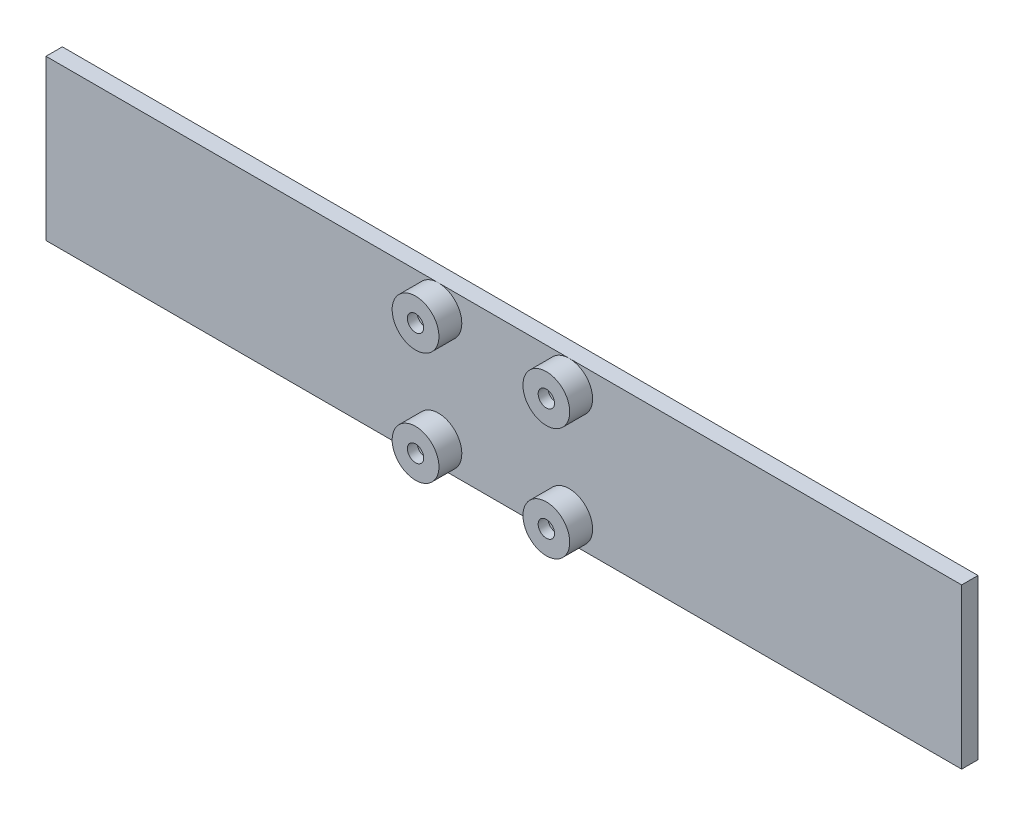
ISO-10303-21;
HEADER;
FILE_DESCRIPTION(('STEP AP214'),'2;1');
FILE_NAME('part.step','',(''),(''),'','','');
FILE_SCHEMA(('AUTOMOTIVE_DESIGN { 1 0 10303 214 1 1 1 1 }'));
ENDSEC;
DATA;
#1=APPLICATION_CONTEXT('core data for automotive mechanical design processes');
#2=APPLICATION_PROTOCOL_DEFINITION('international standard','automotive_design',2000,#1);
#3=PRODUCT_CONTEXT('',#1,'mechanical');
#4=PRODUCT('Part','Part','',(#3));
#5=PRODUCT_RELATED_PRODUCT_CATEGORY('part','',(#4));
#6=PRODUCT_DEFINITION_FORMATION('','',#4);
#7=PRODUCT_DEFINITION_CONTEXT('part definition',#1,'design');
#8=PRODUCT_DEFINITION('design','',#6,#7);
#9=PRODUCT_DEFINITION_SHAPE('','',#8);
#10=(LENGTH_UNIT() NAMED_UNIT(*) SI_UNIT(.MILLI.,.METRE.));
#11=(NAMED_UNIT(*) PLANE_ANGLE_UNIT() SI_UNIT($,.RADIAN.));
#12=(NAMED_UNIT(*) SI_UNIT($,.STERADIAN.) SOLID_ANGLE_UNIT());
#13=UNCERTAINTY_MEASURE_WITH_UNIT(LENGTH_MEASURE(1.E-05),#10,'distance_accuracy_value','');
#14=(GEOMETRIC_REPRESENTATION_CONTEXT(3) GLOBAL_UNCERTAINTY_ASSIGNED_CONTEXT((#13)) GLOBAL_UNIT_ASSIGNED_CONTEXT((#10,
#11,#12)) REPRESENTATION_CONTEXT('',''));
#15=CARTESIAN_POINT('',(0.,0.,0.));
#16=DIRECTION('',(0.,0.,1.));
#17=DIRECTION('',(1.,0.,0.));
#18=AXIS2_PLACEMENT_3D('',#15,#16,#17);
#19=CARTESIAN_POINT('',(-1.58516020236089,28.6172849915683,0.));
#20=DIRECTION('',(0.,0.,1.));
#21=DIRECTION('',(1.,0.,0.));
#22=AXIS2_PLACEMENT_3D('',#19,#20,#21);
#23=CYLINDRICAL_SURFACE('',#22,5.25);
#24=CARTESIAN_POINT('',(-1.58516020236089,28.6172849915683,9.));
#25=DIRECTION('',(0.,0.,1.));
#26=DIRECTION('',(1.,0.,0.));
#27=AXIS2_PLACEMENT_3D('',#24,#25,#26);
#28=CIRCLE('',#27,5.25);
#29=CARTESIAN_POINT('',(3.66483979763911,28.6172849915683,9.));
#30=VERTEX_POINT('',#29);
#31=EDGE_CURVE('E108',#30,#30,#28,.F.);
#32=ORIENTED_EDGE('',*,*,#31,.F.);
#33=EDGE_LOOP('',(#32));
#34=FACE_BOUND('',#33,.T.);
#35=CARTESIAN_POINT('',(-1.58516020236089,28.6172849915683,0.));
#36=DIRECTION('',(0.,0.,1.));
#37=DIRECTION('',(1.,0.,0.));
#38=AXIS2_PLACEMENT_3D('',#35,#36,#37);
#39=CIRCLE('',#38,5.25);
#40=CARTESIAN_POINT('',(3.66483979763911,28.6172849915683,0.));
#41=VERTEX_POINT('',#40);
#42=EDGE_CURVE('E186',#41,#41,#39,.T.);
#43=ORIENTED_EDGE('',*,*,#42,.F.);
#44=EDGE_LOOP('',(#43));
#45=FACE_BOUND('',#44,.T.);
#46=ADVANCED_FACE('F45',(#34,#45),#23,.F.);
#47=CARTESIAN_POINT('',(-1.58516020236089,28.6172849915683,12.));
#48=DIRECTION('',(0.,0.,1.));
#49=DIRECTION('',(1.,0.,0.));
#50=AXIS2_PLACEMENT_3D('',#47,#48,#49);
#51=PLANE('',#50);
#52=CARTESIAN_POINT('',(-1.58516020236089,28.6172849915683,12.));
#53=DIRECTION('',(0.,0.,1.));
#54=DIRECTION('',(1.,0.,0.));
#55=AXIS2_PLACEMENT_3D('',#52,#53,#54);
#56=CIRCLE('',#55,7.14999999999999);
#57=CARTESIAN_POINT('',(5.5648397976391,28.6172849915683,12.));
#58=VERTEX_POINT('',#57);
#59=EDGE_CURVE('E179',#58,#58,#56,.T.);
#60=ORIENTED_EDGE('',*,*,#59,.T.);
#61=EDGE_LOOP('',(#60));
#62=FACE_BOUND('',#61,.T.);
#63=CARTESIAN_POINT('',(-1.58516020236089,28.6172849915683,12.));
#64=DIRECTION('',(0.,0.,1.));
#65=DIRECTION('',(1.,0.,0.));
#66=AXIS2_PLACEMENT_3D('',#63,#64,#65);
#67=CIRCLE('',#66,2.5);
#68=CARTESIAN_POINT('',(0.914839797639113,28.6172849915683,12.));
#69=VERTEX_POINT('',#68);
#70=EDGE_CURVE('E158',#69,#69,#67,.T.);
#71=ORIENTED_EDGE('',*,*,#70,.F.);
#72=EDGE_LOOP('',(#71));
#73=FACE_BOUND('',#72,.T.);
#74=ADVANCED_FACE('F247',(#62,#73),#51,.T.);
#75=CARTESIAN_POINT('',(-1.58516020236089,28.6172849915683,12.));
#76=DIRECTION('',(0.,0.,-1.));
#77=DIRECTION('',(-1.,0.,0.));
#78=AXIS2_PLACEMENT_3D('',#75,#76,#77);
#79=CYLINDRICAL_SURFACE('',#78,7.14999999999999);
#80=CARTESIAN_POINT('',(-1.58516020236089,28.6172849915683,5.));
#81=DIRECTION('',(0.,0.,1.));
#82=DIRECTION('',(1.,0.,0.));
#83=AXIS2_PLACEMENT_3D('',#80,#81,#82);
#84=CIRCLE('',#83,7.14999999999999);
#85=CARTESIAN_POINT('',(-1.58516020236089,35.7672849915683,5.));
#86=VERTEX_POINT('',#85);
#87=EDGE_CURVE('E133',#86,#86,#84,.T.);
#88=ORIENTED_EDGE('',*,*,#87,.T.);
#89=EDGE_LOOP('',(#88));
#90=FACE_BOUND('',#89,.T.);
#91=ORIENTED_EDGE('',*,*,#59,.F.);
#92=EDGE_LOOP('',(#91));
#93=FACE_BOUND('',#92,.T.);
#94=ADVANCED_FACE('F254',(#90,#93),#79,.T.);
#95=CARTESIAN_POINT('',(-1.58516020236089,28.6172849915683,9.));
#96=DIRECTION('',(0.,0.,1.));
#97=DIRECTION('',(1.,0.,0.));
#98=AXIS2_PLACEMENT_3D('',#95,#96,#97);
#99=PLANE('',#98);
#100=CARTESIAN_POINT('',(-1.58516020236089,28.6172849915683,9.));
#101=DIRECTION('',(0.,0.,1.));
#102=DIRECTION('',(1.,0.,0.));
#103=AXIS2_PLACEMENT_3D('',#100,#101,#102);
#104=CIRCLE('',#103,2.5);
#105=CARTESIAN_POINT('',(0.914839797639113,28.6172849915683,9.));
#106=VERTEX_POINT('',#105);
#107=EDGE_CURVE('E163',#106,#106,#104,.T.);
#108=ORIENTED_EDGE('',*,*,#107,.T.);
#109=EDGE_LOOP('',(#108));
#110=FACE_BOUND('',#109,.T.);
#111=ORIENTED_EDGE('',*,*,#31,.T.);
#112=EDGE_LOOP('',(#111));
#113=FACE_BOUND('',#112,.T.);
#114=ADVANCED_FACE('F291',(#110,#113),#99,.F.);
#115=CARTESIAN_POINT('',(-1.58516020236089,28.6172849915683,9.));
#116=DIRECTION('',(0.,0.,1.));
#117=DIRECTION('',(1.,0.,0.));
#118=AXIS2_PLACEMENT_3D('',#115,#116,#117);
#119=CYLINDRICAL_SURFACE('',#118,2.5);
#120=ORIENTED_EDGE('',*,*,#107,.F.);
#121=EDGE_LOOP('',(#120));
#122=FACE_BOUND('',#121,.T.);
#123=ORIENTED_EDGE('',*,*,#70,.T.);
#124=EDGE_LOOP('',(#123));
#125=FACE_BOUND('',#124,.T.);
#126=ADVANCED_FACE('F283',(#122,#125),#119,.F.);
#127=CARTESIAN_POINT('',(0.,0.,5.));
#128=DIRECTION('',(0.,0.,1.));
#129=DIRECTION('',(1.,0.,0.));
#130=AXIS2_PLACEMENT_3D('',#127,#128,#129);
#131=PLANE('',#130);
#132=DIRECTION('',(-1.,0.,0.));
#133=VECTOR('',#132,1.);
#134=CARTESIAN_POINT('',(-121.585160202361,35.7672849915683,5.));
#135=LINE('',#134,#133);
#136=CARTESIAN_POINT('',(38.4148397976391,35.7672849915683,5.));
#137=VERTEX_POINT('',#136);
#138=EDGE_CURVE('E60',#137,#86,#135,.T.);
#139=ORIENTED_EDGE('',*,*,#138,.T.);
#140=ORIENTED_EDGE('',*,*,#87,.F.);
#141=CARTESIAN_POINT('',(-121.585160202361,35.7672849915683,5.));
#142=VERTEX_POINT('',#141);
#143=EDGE_CURVE('E121',#86,#142,#135,.T.);
#144=ORIENTED_EDGE('',*,*,#143,.T.);
#145=DIRECTION('',(0.,-1.,0.));
#146=VECTOR('',#145,1.);
#147=CARTESIAN_POINT('',(-121.585160202361,35.7672849915683,5.));
#148=LINE('',#147,#146);
#149=CARTESIAN_POINT('',(-121.585160202361,-13.0327150084317,5.));
#150=VERTEX_POINT('',#149);
#151=EDGE_CURVE('E104',#142,#150,#148,.T.);
#152=ORIENTED_EDGE('',*,*,#151,.T.);
#153=DIRECTION('',(1.,0.,0.));
#154=VECTOR('',#153,1.);
#155=CARTESIAN_POINT('',(-121.585160202361,-13.0327150084317,5.));
#156=LINE('',#155,#154);
#157=CARTESIAN_POINT('',(-1.58516020236088,-13.0327150084317,5.));
#158=VERTEX_POINT('',#157);
#159=EDGE_CURVE('E111',#150,#158,#156,.T.);
#160=ORIENTED_EDGE('',*,*,#159,.T.);
#161=CARTESIAN_POINT('',(-1.58516020236088,-5.8827150084317,5.));
#162=DIRECTION('',(0.,0.,1.));
#163=DIRECTION('',(1.,0.,0.));
#164=AXIS2_PLACEMENT_3D('',#161,#162,#163);
#165=CIRCLE('',#164,7.15);
#166=EDGE_CURVE('E127',#158,#158,#165,.T.);
#167=ORIENTED_EDGE('',*,*,#166,.F.);
#168=CARTESIAN_POINT('',(38.4148397976391,-13.0327150084317,5.));
#169=VERTEX_POINT('',#168);
#170=EDGE_CURVE('E114',#158,#169,#156,.T.);
#171=ORIENTED_EDGE('',*,*,#170,.T.);
#172=CARTESIAN_POINT('',(38.4148397976391,-5.8827150084317,5.));
#173=DIRECTION('',(0.,0.,1.));
#174=DIRECTION('',(1.,0.,0.));
#175=AXIS2_PLACEMENT_3D('',#172,#173,#174);
#176=CIRCLE('',#175,7.15);
#177=EDGE_CURVE('E11',#169,#169,#176,.T.);
#178=ORIENTED_EDGE('',*,*,#177,.F.);
#179=CARTESIAN_POINT('',(158.414839797639,-13.0327150084317,5.));
#180=VERTEX_POINT('',#179);
#181=EDGE_CURVE('E118',#169,#180,#156,.T.);
#182=ORIENTED_EDGE('',*,*,#181,.T.);
#183=DIRECTION('',(0.,1.,0.));
#184=VECTOR('',#183,1.);
#185=CARTESIAN_POINT('',(158.414839797639,35.7672849915683,5.));
#186=LINE('',#185,#184);
#187=CARTESIAN_POINT('',(158.414839797639,35.7672849915683,5.));
#188=VERTEX_POINT('',#187);
#189=EDGE_CURVE('E116',#180,#188,#186,.T.);
#190=ORIENTED_EDGE('',*,*,#189,.T.);
#191=EDGE_CURVE('E66',#188,#137,#135,.T.);
#192=ORIENTED_EDGE('',*,*,#191,.T.);
#193=CARTESIAN_POINT('',(38.4148397976391,28.6172849915683,5.));
#194=DIRECTION('',(0.,0.,1.));
#195=DIRECTION('',(1.,0.,0.));
#196=AXIS2_PLACEMENT_3D('',#193,#194,#195);
#197=CIRCLE('',#196,7.14999999999998);
#198=EDGE_CURVE('E130',#137,#137,#197,.T.);
#199=ORIENTED_EDGE('',*,*,#198,.F.);
#200=EDGE_LOOP('',(#139,#140,#144,#152,#160,#167,#171,#178,#182,#190,#192,#199));
#201=FACE_BOUND('',#200,.T.);
#202=ADVANCED_FACE('F120',(#201),#131,.T.);
#203=CARTESIAN_POINT('',(-1.58516020236088,-5.8827150084317,9.));
#204=DIRECTION('',(0.,0.,1.));
#205=DIRECTION('',(1.,0.,0.));
#206=AXIS2_PLACEMENT_3D('',#203,#204,#205);
#207=PLANE('',#206);
#208=CARTESIAN_POINT('',(-1.58516020236088,-5.8827150084317,9.));
#209=DIRECTION('',(0.,0.,1.));
#210=DIRECTION('',(1.,0.,0.));
#211=AXIS2_PLACEMENT_3D('',#208,#209,#210);
#212=CIRCLE('',#211,2.5);
#213=CARTESIAN_POINT('',(0.914839797639124,-5.8827150084317,9.));
#214=VERTEX_POINT('',#213);
#215=EDGE_CURVE('E140',#214,#214,#212,.T.);
#216=ORIENTED_EDGE('',*,*,#215,.T.);
#217=EDGE_LOOP('',(#216));
#218=FACE_BOUND('',#217,.T.);
#219=CARTESIAN_POINT('',(-1.58516020236088,-5.8827150084317,9.));
#220=DIRECTION('',(0.,0.,1.));
#221=DIRECTION('',(1.,0.,0.));
#222=AXIS2_PLACEMENT_3D('',#219,#220,#221);
#223=CIRCLE('',#222,5.25);
#224=CARTESIAN_POINT('',(3.66483979763912,-5.8827150084317,9.));
#225=VERTEX_POINT('',#224);
#226=EDGE_CURVE('E145',#225,#225,#223,.F.);
#227=ORIENTED_EDGE('',*,*,#226,.T.);
#228=EDGE_LOOP('',(#227));
#229=FACE_BOUND('',#228,.T.);
#230=ADVANCED_FACE('F282',(#218,#229),#207,.F.);
#231=CARTESIAN_POINT('',(-1.58516020236088,-5.8827150084317,0.));
#232=DIRECTION('',(0.,0.,1.));
#233=DIRECTION('',(1.,0.,0.));
#234=AXIS2_PLACEMENT_3D('',#231,#232,#233);
#235=CYLINDRICAL_SURFACE('',#234,5.25);
#236=ORIENTED_EDGE('',*,*,#226,.F.);
#237=EDGE_LOOP('',(#236));
#238=FACE_BOUND('',#237,.T.);
#239=CARTESIAN_POINT('',(-1.58516020236088,-5.8827150084317,0.));
#240=DIRECTION('',(0.,0.,1.));
#241=DIRECTION('',(1.,0.,0.));
#242=AXIS2_PLACEMENT_3D('',#239,#240,#241);
#243=CIRCLE('',#242,5.25);
#244=CARTESIAN_POINT('',(3.66483979763912,-5.8827150084317,0.));
#245=VERTEX_POINT('',#244);
#246=EDGE_CURVE('E183',#245,#245,#243,.T.);
#247=ORIENTED_EDGE('',*,*,#246,.F.);
#248=EDGE_LOOP('',(#247));
#249=FACE_BOUND('',#248,.T.);
#250=ADVANCED_FACE('F288',(#238,#249),#235,.F.);
#251=CARTESIAN_POINT('',(-1.58516020236088,-5.8827150084317,9.));
#252=DIRECTION('',(0.,0.,1.));
#253=DIRECTION('',(1.,0.,0.));
#254=AXIS2_PLACEMENT_3D('',#251,#252,#253);
#255=CYLINDRICAL_SURFACE('',#254,2.5);
#256=ORIENTED_EDGE('',*,*,#215,.F.);
#257=EDGE_LOOP('',(#256));
#258=FACE_BOUND('',#257,.T.);
#259=CARTESIAN_POINT('',(-1.58516020236088,-5.8827150084317,12.));
#260=DIRECTION('',(0.,0.,1.));
#261=DIRECTION('',(1.,0.,0.));
#262=AXIS2_PLACEMENT_3D('',#259,#260,#261);
#263=CIRCLE('',#262,2.5);
#264=CARTESIAN_POINT('',(0.914839797639124,-5.8827150084317,12.));
#265=VERTEX_POINT('',#264);
#266=EDGE_CURVE('E146',#265,#265,#263,.T.);
#267=ORIENTED_EDGE('',*,*,#266,.T.);
#268=EDGE_LOOP('',(#267));
#269=FACE_BOUND('',#268,.T.);
#270=ADVANCED_FACE('F313',(#258,#269),#255,.F.);
#271=CARTESIAN_POINT('',(-1.58516020236088,-5.8827150084317,12.));
#272=DIRECTION('',(0.,0.,1.));
#273=DIRECTION('',(1.,0.,0.));
#274=AXIS2_PLACEMENT_3D('',#271,#272,#273);
#275=PLANE('',#274);
#276=CARTESIAN_POINT('',(-1.58516020236088,-5.8827150084317,12.));
#277=DIRECTION('',(0.,0.,1.));
#278=DIRECTION('',(1.,0.,0.));
#279=AXIS2_PLACEMENT_3D('',#276,#277,#278);
#280=CIRCLE('',#279,7.15);
#281=CARTESIAN_POINT('',(5.56483979763913,-5.8827150084317,12.));
#282=VERTEX_POINT('',#281);
#283=EDGE_CURVE('E173',#282,#282,#280,.T.);
#284=ORIENTED_EDGE('',*,*,#283,.T.);
#285=EDGE_LOOP('',(#284));
#286=FACE_BOUND('',#285,.T.);
#287=ORIENTED_EDGE('',*,*,#266,.F.);
#288=EDGE_LOOP('',(#287));
#289=FACE_BOUND('',#288,.T.);
#290=ADVANCED_FACE('F309',(#286,#289),#275,.T.);
#291=CARTESIAN_POINT('',(-1.58516020236088,-5.8827150084317,12.));
#292=DIRECTION('',(0.,0.,-1.));
#293=DIRECTION('',(-1.,0.,0.));
#294=AXIS2_PLACEMENT_3D('',#291,#292,#293);
#295=CYLINDRICAL_SURFACE('',#294,7.15);
#296=ORIENTED_EDGE('',*,*,#166,.T.);
#297=EDGE_LOOP('',(#296));
#298=FACE_BOUND('',#297,.T.);
#299=ORIENTED_EDGE('',*,*,#283,.F.);
#300=EDGE_LOOP('',(#299));
#301=FACE_BOUND('',#300,.T.);
#302=ADVANCED_FACE('F306',(#298,#301),#295,.T.);
#303=CARTESIAN_POINT('',(38.4148397976391,28.6172849915683,9.));
#304=DIRECTION('',(0.,0.,1.));
#305=DIRECTION('',(1.,0.,0.));
#306=AXIS2_PLACEMENT_3D('',#303,#304,#305);
#307=PLANE('',#306);
#308=CARTESIAN_POINT('',(38.4148397976391,28.6172849915683,9.));
#309=DIRECTION('',(0.,0.,1.));
#310=DIRECTION('',(1.,0.,0.));
#311=AXIS2_PLACEMENT_3D('',#308,#309,#310);
#312=CIRCLE('',#311,2.5);
#313=CARTESIAN_POINT('',(40.9148397976391,28.6172849915683,9.));
#314=VERTEX_POINT('',#313);
#315=EDGE_CURVE('E149',#314,#314,#312,.T.);
#316=ORIENTED_EDGE('',*,*,#315,.T.);
#317=EDGE_LOOP('',(#316));
#318=FACE_BOUND('',#317,.T.);
#319=CARTESIAN_POINT('',(38.4148397976391,28.6172849915683,9.));
#320=DIRECTION('',(0.,0.,1.));
#321=DIRECTION('',(1.,0.,0.));
#322=AXIS2_PLACEMENT_3D('',#319,#320,#321);
#323=CIRCLE('',#322,5.25);
#324=CARTESIAN_POINT('',(43.6648397976391,28.6172849915683,9.));
#325=VERTEX_POINT('',#324);
#326=EDGE_CURVE('E154',#325,#325,#323,.F.);
#327=ORIENTED_EDGE('',*,*,#326,.T.);
#328=EDGE_LOOP('',(#327));
#329=FACE_BOUND('',#328,.T.);
#330=ADVANCED_FACE('F308',(#318,#329),#307,.F.);
#331=CARTESIAN_POINT('',(38.4148397976391,28.6172849915683,0.));
#332=DIRECTION('',(0.,0.,1.));
#333=DIRECTION('',(1.,0.,0.));
#334=AXIS2_PLACEMENT_3D('',#331,#332,#333);
#335=CYLINDRICAL_SURFACE('',#334,5.25);
#336=ORIENTED_EDGE('',*,*,#326,.F.);
#337=EDGE_LOOP('',(#336));
#338=FACE_BOUND('',#337,.T.);
#339=CARTESIAN_POINT('',(38.4148397976391,28.6172849915683,0.));
#340=DIRECTION('',(0.,0.,1.));
#341=DIRECTION('',(1.,0.,0.));
#342=AXIS2_PLACEMENT_3D('',#339,#340,#341);
#343=CIRCLE('',#342,5.25);
#344=CARTESIAN_POINT('',(43.6648397976391,28.6172849915683,0.));
#345=VERTEX_POINT('',#344);
#346=EDGE_CURVE('E182',#345,#345,#343,.T.);
#347=ORIENTED_EDGE('',*,*,#346,.F.);
#348=EDGE_LOOP('',(#347));
#349=FACE_BOUND('',#348,.T.);
#350=ADVANCED_FACE('F261',(#338,#349),#335,.F.);
#351=CARTESIAN_POINT('',(38.4148397976391,28.6172849915683,9.));
#352=DIRECTION('',(0.,0.,1.));
#353=DIRECTION('',(1.,0.,0.));
#354=AXIS2_PLACEMENT_3D('',#351,#352,#353);
#355=CYLINDRICAL_SURFACE('',#354,2.5);
#356=ORIENTED_EDGE('',*,*,#315,.F.);
#357=EDGE_LOOP('',(#356));
#358=FACE_BOUND('',#357,.T.);
#359=CARTESIAN_POINT('',(38.4148397976391,28.6172849915683,12.));
#360=DIRECTION('',(0.,0.,1.));
#361=DIRECTION('',(1.,0.,0.));
#362=AXIS2_PLACEMENT_3D('',#359,#360,#361);
#363=CIRCLE('',#362,2.5);
#364=CARTESIAN_POINT('',(40.9148397976391,28.6172849915683,12.));
#365=VERTEX_POINT('',#364);
#366=EDGE_CURVE('E155',#365,#365,#363,.T.);
#367=ORIENTED_EDGE('',*,*,#366,.T.);
#368=EDGE_LOOP('',(#367));
#369=FACE_BOUND('',#368,.T.);
#370=ADVANCED_FACE('F303',(#358,#369),#355,.F.);
#371=CARTESIAN_POINT('',(38.4148397976391,28.6172849915683,12.));
#372=DIRECTION('',(0.,0.,1.));
#373=DIRECTION('',(1.,0.,0.));
#374=AXIS2_PLACEMENT_3D('',#371,#372,#373);
#375=PLANE('',#374);
#376=CARTESIAN_POINT('',(38.4148397976391,28.6172849915683,12.));
#377=DIRECTION('',(0.,0.,1.));
#378=DIRECTION('',(1.,0.,0.));
#379=AXIS2_PLACEMENT_3D('',#376,#377,#378);
#380=CIRCLE('',#379,7.14999999999998);
#381=CARTESIAN_POINT('',(45.5648397976391,28.6172849915683,12.));
#382=VERTEX_POINT('',#381);
#383=EDGE_CURVE('E176',#382,#382,#380,.T.);
#384=ORIENTED_EDGE('',*,*,#383,.T.);
#385=EDGE_LOOP('',(#384));
#386=FACE_BOUND('',#385,.T.);
#387=ORIENTED_EDGE('',*,*,#366,.F.);
#388=EDGE_LOOP('',(#387));
#389=FACE_BOUND('',#388,.T.);
#390=ADVANCED_FACE('F317',(#386,#389),#375,.T.);
#391=CARTESIAN_POINT('',(38.4148397976391,28.6172849915683,12.));
#392=DIRECTION('',(0.,0.,-1.));
#393=DIRECTION('',(-1.,0.,0.));
#394=AXIS2_PLACEMENT_3D('',#391,#392,#393);
#395=CYLINDRICAL_SURFACE('',#394,7.14999999999998);
#396=ORIENTED_EDGE('',*,*,#198,.T.);
#397=EDGE_LOOP('',(#396));
#398=FACE_BOUND('',#397,.T.);
#399=ORIENTED_EDGE('',*,*,#383,.F.);
#400=EDGE_LOOP('',(#399));
#401=FACE_BOUND('',#400,.T.);
#402=ADVANCED_FACE('F264',(#398,#401),#395,.T.);
#403=CARTESIAN_POINT('',(0.,0.,0.));
#404=DIRECTION('',(0.,0.,1.));
#405=DIRECTION('',(1.,0.,0.));
#406=AXIS2_PLACEMENT_3D('',#403,#404,#405);
#407=PLANE('',#406);
#408=ORIENTED_EDGE('',*,*,#346,.T.);
#409=EDGE_LOOP('',(#408));
#410=FACE_BOUND('',#409,.T.);
#411=CARTESIAN_POINT('',(38.4148397976391,-5.8827150084317,0.));
#412=DIRECTION('',(0.,0.,1.));
#413=DIRECTION('',(1.,0.,0.));
#414=AXIS2_PLACEMENT_3D('',#411,#412,#413);
#415=CIRCLE('',#414,5.25);
#416=CARTESIAN_POINT('',(43.6648397976391,-5.8827150084317,0.));
#417=VERTEX_POINT('',#416);
#418=EDGE_CURVE('E187',#417,#417,#415,.T.);
#419=ORIENTED_EDGE('',*,*,#418,.T.);
#420=EDGE_LOOP('',(#419));
#421=FACE_BOUND('',#420,.T.);
#422=ORIENTED_EDGE('',*,*,#246,.T.);
#423=EDGE_LOOP('',(#422));
#424=FACE_BOUND('',#423,.T.);
#425=ORIENTED_EDGE('',*,*,#42,.T.);
#426=EDGE_LOOP('',(#425));
#427=FACE_BOUND('',#426,.T.);
#428=DIRECTION('',(0.,-1.,0.));
#429=VECTOR('',#428,1.);
#430=CARTESIAN_POINT('',(-121.585160202361,35.7672849915683,0.));
#431=LINE('',#430,#429);
#432=CARTESIAN_POINT('',(-121.585160202361,35.7672849915683,0.));
#433=VERTEX_POINT('',#432);
#434=CARTESIAN_POINT('',(-121.585160202361,-13.0327150084317,0.));
#435=VERTEX_POINT('',#434);
#436=EDGE_CURVE('E106',#433,#435,#431,.T.);
#437=ORIENTED_EDGE('',*,*,#436,.F.);
#438=DIRECTION('',(-1.,0.,0.));
#439=VECTOR('',#438,1.);
#440=CARTESIAN_POINT('',(-121.585160202361,35.7672849915683,0.));
#441=LINE('',#440,#439);
#442=CARTESIAN_POINT('',(158.414839797639,35.7672849915683,0.));
#443=VERTEX_POINT('',#442);
#444=EDGE_CURVE('E199',#443,#433,#441,.T.);
#445=ORIENTED_EDGE('',*,*,#444,.F.);
#446=DIRECTION('',(0.,1.,0.));
#447=VECTOR('',#446,1.);
#448=CARTESIAN_POINT('',(158.414839797639,35.7672849915683,0.));
#449=LINE('',#448,#447);
#450=CARTESIAN_POINT('',(158.414839797639,-13.0327150084317,0.));
#451=VERTEX_POINT('',#450);
#452=EDGE_CURVE('E197',#451,#443,#449,.T.);
#453=ORIENTED_EDGE('',*,*,#452,.F.);
#454=DIRECTION('',(1.,0.,0.));
#455=VECTOR('',#454,1.);
#456=CARTESIAN_POINT('',(-121.585160202361,-13.0327150084317,0.));
#457=LINE('',#456,#455);
#458=EDGE_CURVE('E195',#435,#451,#457,.T.);
#459=ORIENTED_EDGE('',*,*,#458,.F.);
#460=EDGE_LOOP('',(#437,#445,#453,#459));
#461=FACE_BOUND('',#460,.T.);
#462=ADVANCED_FACE('F213',(#410,#421,#424,#427,#461),#407,.F.);
#463=CARTESIAN_POINT('',(-121.585160202361,35.7672849915683,4.));
#464=DIRECTION('',(0.,-1.,0.));
#465=DIRECTION('',(0.,0.,-1.));
#466=AXIS2_PLACEMENT_3D('',#463,#464,#465);
#467=PLANE('',#466);
#468=ORIENTED_EDGE('',*,*,#444,.T.);
#469=DIRECTION('',(0.,0.,-1.));
#470=VECTOR('',#469,1.);
#471=CARTESIAN_POINT('',(-121.585160202361,35.7672849915683,4.));
#472=LINE('',#471,#470);
#473=EDGE_CURVE('E201',#142,#433,#472,.T.);
#474=ORIENTED_EDGE('',*,*,#473,.F.);
#475=ORIENTED_EDGE('',*,*,#143,.F.);
#476=ORIENTED_EDGE('',*,*,#138,.F.);
#477=ORIENTED_EDGE('',*,*,#191,.F.);
#478=DIRECTION('',(0.,0.,-1.));
#479=VECTOR('',#478,1.);
#480=CARTESIAN_POINT('',(158.414839797639,35.7672849915683,4.));
#481=LINE('',#480,#479);
#482=EDGE_CURVE('E203',#188,#443,#481,.T.);
#483=ORIENTED_EDGE('',*,*,#482,.T.);
#484=EDGE_LOOP('',(#468,#474,#475,#476,#477,#483));
#485=FACE_BOUND('',#484,.T.);
#486=ADVANCED_FACE('F215',(#485),#467,.F.);
#487=CARTESIAN_POINT('',(158.414839797639,35.7672849915683,4.));
#488=DIRECTION('',(-1.,0.,0.));
#489=DIRECTION('',(0.,-1.,0.));
#490=AXIS2_PLACEMENT_3D('',#487,#488,#489);
#491=PLANE('',#490);
#492=ORIENTED_EDGE('',*,*,#452,.T.);
#493=ORIENTED_EDGE('',*,*,#482,.F.);
#494=ORIENTED_EDGE('',*,*,#189,.F.);
#495=DIRECTION('',(0.,0.,-1.));
#496=VECTOR('',#495,1.);
#497=CARTESIAN_POINT('',(158.414839797639,-13.0327150084317,4.));
#498=LINE('',#497,#496);
#499=EDGE_CURVE('E109',#180,#451,#498,.T.);
#500=ORIENTED_EDGE('',*,*,#499,.T.);
#501=EDGE_LOOP('',(#492,#493,#494,#500));
#502=FACE_BOUND('',#501,.T.);
#503=ADVANCED_FACE('F210',(#502),#491,.F.);
#504=CARTESIAN_POINT('',(-121.585160202361,-13.0327150084317,4.));
#505=DIRECTION('',(0.,1.,0.));
#506=DIRECTION('',(0.,0.,1.));
#507=AXIS2_PLACEMENT_3D('',#504,#505,#506);
#508=PLANE('',#507);
#509=ORIENTED_EDGE('',*,*,#458,.T.);
#510=ORIENTED_EDGE('',*,*,#499,.F.);
#511=ORIENTED_EDGE('',*,*,#181,.F.);
#512=ORIENTED_EDGE('',*,*,#170,.F.);
#513=ORIENTED_EDGE('',*,*,#159,.F.);
#514=DIRECTION('',(0.,0.,-1.));
#515=VECTOR('',#514,1.);
#516=CARTESIAN_POINT('',(-121.585160202361,-13.0327150084317,4.));
#517=LINE('',#516,#515);
#518=EDGE_CURVE('E100',#150,#435,#517,.T.);
#519=ORIENTED_EDGE('',*,*,#518,.T.);
#520=EDGE_LOOP('',(#509,#510,#511,#512,#513,#519));
#521=FACE_BOUND('',#520,.T.);
#522=ADVANCED_FACE('F112',(#521),#508,.F.);
#523=CARTESIAN_POINT('',(-121.585160202361,35.7672849915683,4.));
#524=DIRECTION('',(1.,0.,0.));
#525=DIRECTION('',(0.,1.,0.));
#526=AXIS2_PLACEMENT_3D('',#523,#524,#525);
#527=PLANE('',#526);
#528=ORIENTED_EDGE('',*,*,#436,.T.);
#529=ORIENTED_EDGE('',*,*,#518,.F.);
#530=ORIENTED_EDGE('',*,*,#151,.F.);
#531=ORIENTED_EDGE('',*,*,#473,.T.);
#532=EDGE_LOOP('',(#528,#529,#530,#531));
#533=FACE_BOUND('',#532,.T.);
#534=ADVANCED_FACE('F47',(#533),#527,.F.);
#535=CARTESIAN_POINT('',(38.4148397976391,-5.8827150084317,9.));
#536=DIRECTION('',(0.,0.,1.));
#537=DIRECTION('',(1.,0.,0.));
#538=AXIS2_PLACEMENT_3D('',#535,#536,#537);
#539=PLANE('',#538);
#540=CARTESIAN_POINT('',(38.4148397976391,-5.8827150084317,9.));
#541=DIRECTION('',(0.,0.,1.));
#542=DIRECTION('',(1.,0.,0.));
#543=AXIS2_PLACEMENT_3D('',#540,#541,#542);
#544=CIRCLE('',#543,2.5);
#545=CARTESIAN_POINT('',(40.9148397976391,-5.8827150084317,9.));
#546=VERTEX_POINT('',#545);
#547=EDGE_CURVE('E136',#546,#546,#544,.T.);
#548=ORIENTED_EDGE('',*,*,#547,.T.);
#549=EDGE_LOOP('',(#548));
#550=FACE_BOUND('',#549,.T.);
#551=CARTESIAN_POINT('',(38.4148397976391,-5.8827150084317,9.));
#552=DIRECTION('',(0.,0.,1.));
#553=DIRECTION('',(1.,0.,0.));
#554=AXIS2_PLACEMENT_3D('',#551,#552,#553);
#555=CIRCLE('',#554,5.25);
#556=CARTESIAN_POINT('',(43.6648397976391,-5.8827150084317,9.));
#557=VERTEX_POINT('',#556);
#558=EDGE_CURVE('E53',#557,#557,#555,.F.);
#559=ORIENTED_EDGE('',*,*,#558,.T.);
#560=EDGE_LOOP('',(#559));
#561=FACE_BOUND('',#560,.T.);
#562=ADVANCED_FACE('F240',(#550,#561),#539,.F.);
#563=CARTESIAN_POINT('',(38.4148397976391,-5.8827150084317,0.));
#564=DIRECTION('',(0.,0.,1.));
#565=DIRECTION('',(1.,0.,0.));
#566=AXIS2_PLACEMENT_3D('',#563,#564,#565);
#567=CYLINDRICAL_SURFACE('',#566,5.25);
#568=ORIENTED_EDGE('',*,*,#558,.F.);
#569=EDGE_LOOP('',(#568));
#570=FACE_BOUND('',#569,.T.);
#571=ORIENTED_EDGE('',*,*,#418,.F.);
#572=EDGE_LOOP('',(#571));
#573=FACE_BOUND('',#572,.T.);
#574=ADVANCED_FACE('F232',(#570,#573),#567,.F.);
#575=CARTESIAN_POINT('',(38.4148397976391,-5.8827150084317,9.));
#576=DIRECTION('',(0.,0.,1.));
#577=DIRECTION('',(1.,0.,0.));
#578=AXIS2_PLACEMENT_3D('',#575,#576,#577);
#579=CYLINDRICAL_SURFACE('',#578,2.5);
#580=ORIENTED_EDGE('',*,*,#547,.F.);
#581=EDGE_LOOP('',(#580));
#582=FACE_BOUND('',#581,.T.);
#583=CARTESIAN_POINT('',(38.4148397976391,-5.8827150084317,12.));
#584=DIRECTION('',(0.,0.,1.));
#585=DIRECTION('',(1.,0.,0.));
#586=AXIS2_PLACEMENT_3D('',#583,#584,#585);
#587=CIRCLE('',#586,2.5);
#588=CARTESIAN_POINT('',(40.9148397976391,-5.8827150084317,12.));
#589=VERTEX_POINT('',#588);
#590=EDGE_CURVE('E137',#589,#589,#587,.T.);
#591=ORIENTED_EDGE('',*,*,#590,.T.);
#592=EDGE_LOOP('',(#591));
#593=FACE_BOUND('',#592,.T.);
#594=ADVANCED_FACE('F227',(#582,#593),#579,.F.);
#595=CARTESIAN_POINT('',(38.4148397976391,-5.8827150084317,12.));
#596=DIRECTION('',(0.,0.,1.));
#597=DIRECTION('',(1.,0.,0.));
#598=AXIS2_PLACEMENT_3D('',#595,#596,#597);
#599=PLANE('',#598);
#600=CARTESIAN_POINT('',(38.4148397976391,-5.8827150084317,12.));
#601=DIRECTION('',(0.,0.,1.));
#602=DIRECTION('',(1.,0.,0.));
#603=AXIS2_PLACEMENT_3D('',#600,#601,#602);
#604=CIRCLE('',#603,7.15);
#605=CARTESIAN_POINT('',(45.5648397976391,-5.8827150084317,12.));
#606=VERTEX_POINT('',#605);
#607=EDGE_CURVE('E166',#606,#606,#604,.T.);
#608=ORIENTED_EDGE('',*,*,#607,.T.);
#609=EDGE_LOOP('',(#608));
#610=FACE_BOUND('',#609,.T.);
#611=ORIENTED_EDGE('',*,*,#590,.F.);
#612=EDGE_LOOP('',(#611));
#613=FACE_BOUND('',#612,.T.);
#614=ADVANCED_FACE('F221',(#610,#613),#599,.T.);
#615=CARTESIAN_POINT('',(38.4148397976391,-5.8827150084317,12.));
#616=DIRECTION('',(0.,0.,-1.));
#617=DIRECTION('',(-1.,0.,0.));
#618=AXIS2_PLACEMENT_3D('',#615,#616,#617);
#619=CYLINDRICAL_SURFACE('',#618,7.15);
#620=ORIENTED_EDGE('',*,*,#177,.T.);
#621=EDGE_LOOP('',(#620));
#622=FACE_BOUND('',#621,.T.);
#623=ORIENTED_EDGE('',*,*,#607,.F.);
#624=EDGE_LOOP('',(#623));
#625=FACE_BOUND('',#624,.T.);
#626=ADVANCED_FACE('F218',(#622,#625),#619,.T.);
#627=CLOSED_SHELL('',(#46,#74,#94,#114,#126,#202,#230,#250,#270,#290,#302,#330,#350,#370,#390,
#402,#462,#486,#503,#522,#534,#562,#574,#594,#614,#626));
#628=MANIFOLD_SOLID_BREP('B2',#627);
#629=ADVANCED_BREP_SHAPE_REPRESENTATION('',(#18,#628),#14);
#630=SHAPE_DEFINITION_REPRESENTATION(#9,#629);
ENDSEC;
END-ISO-10303-21;
